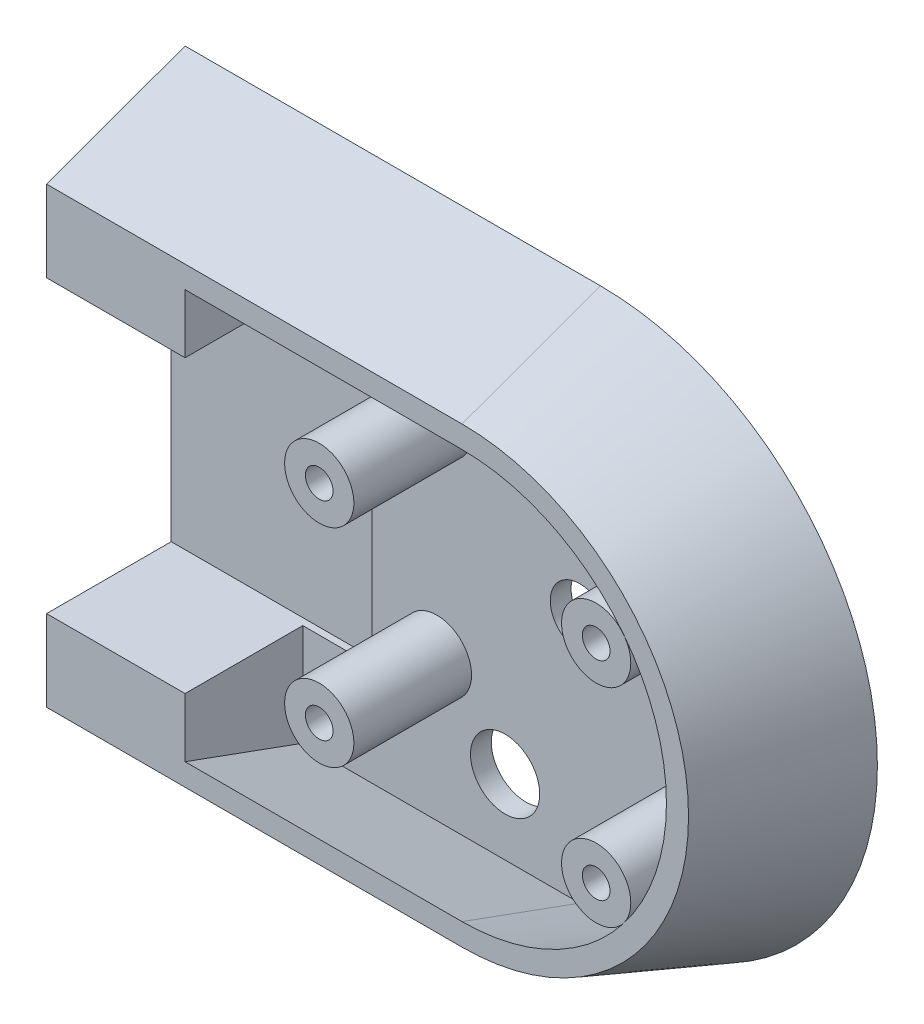
ISO-10303-21;
HEADER;
FILE_DESCRIPTION(('STEP AP214'),'2;1');
FILE_NAME('part.step','',(''),(''),'','','');
FILE_SCHEMA(('AUTOMOTIVE_DESIGN { 1 0 10303 214 1 1 1 1 }'));
ENDSEC;
DATA;
#1=APPLICATION_CONTEXT('core data for automotive mechanical design processes');
#2=APPLICATION_PROTOCOL_DEFINITION('international standard','automotive_design',2000,#1);
#3=PRODUCT_CONTEXT('',#1,'mechanical');
#4=PRODUCT('Part','Part','',(#3));
#5=PRODUCT_RELATED_PRODUCT_CATEGORY('part','',(#4));
#6=PRODUCT_DEFINITION_FORMATION('','',#4);
#7=PRODUCT_DEFINITION_CONTEXT('part definition',#1,'design');
#8=PRODUCT_DEFINITION('design','',#6,#7);
#9=PRODUCT_DEFINITION_SHAPE('','',#8);
#10=(LENGTH_UNIT() NAMED_UNIT(*) SI_UNIT(.MILLI.,.METRE.));
#11=(NAMED_UNIT(*) PLANE_ANGLE_UNIT() SI_UNIT($,.RADIAN.));
#12=(NAMED_UNIT(*) SI_UNIT($,.STERADIAN.) SOLID_ANGLE_UNIT());
#13=UNCERTAINTY_MEASURE_WITH_UNIT(LENGTH_MEASURE(1.E-05),#10,'distance_accuracy_value','');
#14=(GEOMETRIC_REPRESENTATION_CONTEXT(3) GLOBAL_UNCERTAINTY_ASSIGNED_CONTEXT((#13)) GLOBAL_UNIT_ASSIGNED_CONTEXT((#10,
#11,#12)) REPRESENTATION_CONTEXT('',''));
#15=CARTESIAN_POINT('',(0.,0.,0.));
#16=DIRECTION('',(0.,0.,1.));
#17=DIRECTION('',(1.,0.,0.));
#18=AXIS2_PLACEMENT_3D('',#15,#16,#17);
#19=CARTESIAN_POINT('',(-40.,0.,3.));
#20=DIRECTION('',(0.,0.,1.));
#21=DIRECTION('',(1.,0.,0.));
#22=AXIS2_PLACEMENT_3D('',#19,#20,#21);
#23=PLANE('',#22);
#24=CARTESIAN_POINT('',(129.377425117888,-15.,3.));
#25=DIRECTION('',(0.,0.,1.));
#26=DIRECTION('',(1.,0.,0.));
#27=AXIS2_PLACEMENT_3D('',#24,#25,#26);
#28=CIRCLE('',#27,5.00000000000002);
#29=CARTESIAN_POINT('',(134.377425117888,-15.,3.));
#30=VERTEX_POINT('',#29);
#31=EDGE_CURVE('E537',#30,#30,#28,.T.);
#32=ORIENTED_EDGE('',*,*,#31,.F.);
#33=EDGE_LOOP('',(#32));
#34=FACE_BOUND('',#33,.T.);
#35=CARTESIAN_POINT('',(129.377425117888,15.,3.));
#36=DIRECTION('',(0.,0.,1.));
#37=DIRECTION('',(1.,0.,0.));
#38=AXIS2_PLACEMENT_3D('',#35,#36,#37);
#39=CIRCLE('',#38,5.00000000000002);
#40=CARTESIAN_POINT('',(134.377425117888,15.,3.));
#41=VERTEX_POINT('',#40);
#42=EDGE_CURVE('E308',#41,#41,#39,.T.);
#43=ORIENTED_EDGE('',*,*,#42,.F.);
#44=EDGE_LOOP('',(#43));
#45=FACE_BOUND('',#44,.T.);
#46=DIRECTION('',(-1.,0.,0.));
#47=VECTOR('',#46,1.);
#48=CARTESIAN_POINT('',(50.,21.,3.));
#49=LINE('',#48,#47);
#50=CARTESIAN_POINT('',(80.,21.,3.));
#51=VERTEX_POINT('',#50);
#52=CARTESIAN_POINT('',(70.,21.,3.));
#53=VERTEX_POINT('',#52);
#54=EDGE_CURVE('E302',#51,#53,#49,.T.);
#55=ORIENTED_EDGE('',*,*,#54,.F.);
#56=DIRECTION('',(0.,1.,0.));
#57=VECTOR('',#56,1.);
#58=CARTESIAN_POINT('',(80.,21.,3.));
#59=LINE('',#58,#57);
#60=CARTESIAN_POINT('',(80.,-21.,3.));
#61=VERTEX_POINT('',#60);
#62=EDGE_CURVE('E305',#61,#51,#59,.T.);
#63=ORIENTED_EDGE('',*,*,#62,.F.);
#64=DIRECTION('',(1.,0.,0.));
#65=VECTOR('',#64,1.);
#66=CARTESIAN_POINT('',(50.,-21.,3.));
#67=LINE('',#66,#65);
#68=CARTESIAN_POINT('',(70.,-21.,3.));
#69=VERTEX_POINT('',#68);
#70=EDGE_CURVE('E315',#69,#61,#67,.T.);
#71=ORIENTED_EDGE('',*,*,#70,.F.);
#72=DIRECTION('',(0.,1.,0.));
#73=VECTOR('',#72,1.);
#74=CARTESIAN_POINT('',(70.,-35.7155559797737,3.));
#75=LINE('',#74,#73);
#76=CARTESIAN_POINT('',(70.,-35.7155559797737,3.));
#77=VERTEX_POINT('',#76);
#78=EDGE_CURVE('E183',#77,#69,#75,.T.);
#79=ORIENTED_EDGE('',*,*,#78,.F.);
#80=DIRECTION('',(-1.,0.,0.));
#81=VECTOR('',#80,1.);
#82=CARTESIAN_POINT('',(-40.,-35.7155559797737,3.));
#83=LINE('',#82,#81);
#84=CARTESIAN_POINT('',(110.,-35.7155559797737,3.));
#85=VERTEX_POINT('',#84);
#86=EDGE_CURVE('E481',#77,#85,#83,.F.);
#87=ORIENTED_EDGE('',*,*,#86,.T.);
#88=CARTESIAN_POINT('',(110.,0.,3.));
#89=DIRECTION('',(0.,0.,1.));
#90=DIRECTION('',(1.,0.,0.));
#91=AXIS2_PLACEMENT_3D('',#88,#89,#90);
#92=CIRCLE('',#91,35.7155559797737);
#93=CARTESIAN_POINT('',(110.,35.7155559797737,3.));
#94=VERTEX_POINT('',#93);
#95=EDGE_CURVE('E489',#85,#94,#92,.T.);
#96=ORIENTED_EDGE('',*,*,#95,.T.);
#97=DIRECTION('',(1.,0.,0.));
#98=VECTOR('',#97,1.);
#99=CARTESIAN_POINT('',(-40.,35.7155559797737,3.));
#100=LINE('',#99,#98);
#101=CARTESIAN_POINT('',(70.,35.7155559797737,3.));
#102=VERTEX_POINT('',#101);
#103=EDGE_CURVE('E482',#94,#102,#100,.F.);
#104=ORIENTED_EDGE('',*,*,#103,.T.);
#105=DIRECTION('',(0.,1.,0.));
#106=VECTOR('',#105,1.);
#107=CARTESIAN_POINT('',(70.,35.7155559797737,3.));
#108=LINE('',#107,#106);
#109=EDGE_CURVE('E370',#53,#102,#108,.T.);
#110=ORIENTED_EDGE('',*,*,#109,.F.);
#111=EDGE_LOOP('',(#55,#63,#71,#79,#87,#96,#104,#110));
#112=FACE_BOUND('',#111,.T.);
#113=CARTESIAN_POINT('',(110.,0.,3.));
#114=DIRECTION('',(0.,0.,1.));
#115=DIRECTION('',(1.,0.,0.));
#116=AXIS2_PLACEMENT_3D('',#113,#114,#115);
#117=CIRCLE('',#116,4.25000000000001);
#118=CARTESIAN_POINT('',(114.25,0.,3.));
#119=VERTEX_POINT('',#118);
#120=EDGE_CURVE('E405',#119,#119,#117,.T.);
#121=ORIENTED_EDGE('',*,*,#120,.F.);
#122=EDGE_LOOP('',(#121));
#123=FACE_BOUND('',#122,.T.);
#124=CARTESIAN_POINT('',(99.2269745441613,-24.9632167242717,3.));
#125=DIRECTION('',(0.,0.,-1.));
#126=DIRECTION('',(-1.,0.,0.));
#127=AXIS2_PLACEMENT_3D('',#124,#125,#126);
#128=CIRCLE('',#127,5.);
#129=CARTESIAN_POINT('',(94.2269745441613,-24.9632167242717,3.));
#130=VERTEX_POINT('',#129);
#131=EDGE_CURVE('E431',#130,#130,#128,.T.);
#132=ORIENTED_EDGE('',*,*,#131,.T.);
#133=EDGE_LOOP('',(#132));
#134=FACE_BOUND('',#133,.T.);
#135=CARTESIAN_POINT('',(89.3774251178879,-15.,3.));
#136=DIRECTION('',(0.,0.,1.));
#137=DIRECTION('',(1.,0.,0.));
#138=AXIS2_PLACEMENT_3D('',#135,#136,#137);
#139=CIRCLE('',#138,5.);
#140=CARTESIAN_POINT('',(94.3774251178879,-15.,3.));
#141=VERTEX_POINT('',#140);
#142=EDGE_CURVE('E443',#141,#141,#139,.T.);
#143=ORIENTED_EDGE('',*,*,#142,.F.);
#144=EDGE_LOOP('',(#143));
#145=FACE_BOUND('',#144,.T.);
#146=CARTESIAN_POINT('',(89.3774251178879,15.,3.));
#147=DIRECTION('',(0.,0.,1.));
#148=DIRECTION('',(1.,0.,0.));
#149=AXIS2_PLACEMENT_3D('',#146,#147,#148);
#150=CIRCLE('',#149,5.);
#151=CARTESIAN_POINT('',(94.3774251178879,15.,3.));
#152=VERTEX_POINT('',#151);
#153=EDGE_CURVE('E450',#152,#152,#150,.T.);
#154=ORIENTED_EDGE('',*,*,#153,.F.);
#155=EDGE_LOOP('',(#154));
#156=FACE_BOUND('',#155,.T.);
#157=ADVANCED_FACE('F168',(#34,#45,#112,#123,#134,#145,#156),#23,.T.);
#158=CARTESIAN_POINT('',(-40.,-37.1809221376423,-1.02606042997701));
#159=DIRECTION('',(0.,-0.939692620785908,0.342020143325669));
#160=DIRECTION('',(0.,-0.342020143325669,-0.939692620785909));
#161=AXIS2_PLACEMENT_3D('',#158,#159,#160);
#162=PLANE('',#161);
#163=ORIENTED_EDGE('',*,*,#86,.F.);
#164=DIRECTION('',(0.,-0.342020143325669,-0.939692620785909));
#165=VECTOR('',#164,1.);
#166=CARTESIAN_POINT('',(70.,-37.1809221376423,-1.026060429977));
#167=LINE('',#166,#165);
#168=CARTESIAN_POINT('',(70.,-29.5280619972482,20.));
#169=VERTEX_POINT('',#168);
#170=EDGE_CURVE('E190',#77,#169,#167,.F.);
#171=ORIENTED_EDGE('',*,*,#170,.T.);
#172=DIRECTION('',(-1.,0.,0.));
#173=VECTOR('',#172,1.);
#174=CARTESIAN_POINT('',(-40.,-29.5280619972482,20.));
#175=LINE('',#174,#173);
#176=CARTESIAN_POINT('',(110.,-29.5280619972482,20.));
#177=VERTEX_POINT('',#176);
#178=EDGE_CURVE('E454',#169,#177,#175,.F.);
#179=ORIENTED_EDGE('',*,*,#178,.T.);
#180=DIRECTION('',(0.,-0.342020143325669,-0.939692620785908));
#181=VECTOR('',#180,1.);
#182=CARTESIAN_POINT('',(110.,-37.1809221376423,-1.02606042997701));
#183=LINE('',#182,#181);
#184=EDGE_CURVE('E493',#177,#85,#183,.T.);
#185=ORIENTED_EDGE('',*,*,#184,.T.);
#186=EDGE_LOOP('',(#163,#171,#179,#185));
#187=FACE_BOUND('',#186,.T.);
#188=ADVANCED_FACE('F525',(#187),#162,.F.);
#189=CARTESIAN_POINT('',(-40.,-40.,0.));
#190=DIRECTION('',(0.,-0.939692620785908,0.342020143325669));
#191=DIRECTION('',(0.,-0.342020143325669,-0.939692620785909));
#192=AXIS2_PLACEMENT_3D('',#189,#190,#191);
#193=PLANE('',#192);
#194=DIRECTION('',(-1.,0.,0.));
#195=VECTOR('',#194,1.);
#196=CARTESIAN_POINT('',(-40.,-32.7205953146759,20.));
#197=LINE('',#196,#195);
#198=CARTESIAN_POINT('',(50.,-32.720595314676,20.));
#199=VERTEX_POINT('',#198);
#200=CARTESIAN_POINT('',(110.,-32.720595314676,20.));
#201=VERTEX_POINT('',#200);
#202=EDGE_CURVE('E460',#199,#201,#197,.F.);
#203=ORIENTED_EDGE('',*,*,#202,.F.);
#204=DIRECTION('',(0.,-0.342020143325669,-0.939692620785908));
#205=VECTOR('',#204,1.);
#206=CARTESIAN_POINT('',(50.,-40.,0.));
#207=LINE('',#206,#205);
#208=CARTESIAN_POINT('',(50.,-40.,0.));
#209=VERTEX_POINT('',#208);
#210=EDGE_CURVE('E398',#209,#199,#207,.F.);
#211=ORIENTED_EDGE('',*,*,#210,.F.);
#212=DIRECTION('',(1.,0.,0.));
#213=VECTOR('',#212,1.);
#214=CARTESIAN_POINT('',(-40.,-40.,0.));
#215=LINE('',#214,#213);
#216=CARTESIAN_POINT('',(110.,-40.,0.));
#217=VERTEX_POINT('',#216);
#218=EDGE_CURVE('E463',#209,#217,#215,.T.);
#219=ORIENTED_EDGE('',*,*,#218,.T.);
#220=DIRECTION('',(0.,-0.342020143325669,-0.939692620785908));
#221=VECTOR('',#220,1.);
#222=CARTESIAN_POINT('',(110.,-40.,0.));
#223=LINE('',#222,#221);
#224=EDGE_CURVE('E477',#201,#217,#223,.T.);
#225=ORIENTED_EDGE('',*,*,#224,.F.);
#226=EDGE_LOOP('',(#203,#211,#219,#225));
#227=FACE_BOUND('',#226,.T.);
#228=ADVANCED_FACE('F532',(#227),#193,.T.);
#229=CARTESIAN_POINT('',(-40.,37.1809221376423,-1.02606042997701));
#230=DIRECTION('',(0.,0.939692620785908,0.342020143325669));
#231=DIRECTION('',(0.,-0.342020143325669,0.939692620785909));
#232=AXIS2_PLACEMENT_3D('',#229,#230,#231);
#233=PLANE('',#232);
#234=DIRECTION('',(1.,0.,0.));
#235=VECTOR('',#234,1.);
#236=CARTESIAN_POINT('',(-40.,29.5280619972482,20.));
#237=LINE('',#236,#235);
#238=CARTESIAN_POINT('',(110.,29.5280619972482,20.));
#239=VERTEX_POINT('',#238);
#240=CARTESIAN_POINT('',(70.,29.5280619972482,20.));
#241=VERTEX_POINT('',#240);
#242=EDGE_CURVE('E176',#239,#241,#237,.F.);
#243=ORIENTED_EDGE('',*,*,#242,.T.);
#244=DIRECTION('',(0.,-0.342020143325669,0.939692620785909));
#245=VECTOR('',#244,1.);
#246=CARTESIAN_POINT('',(70.,37.1809221376423,-1.02606042997701));
#247=LINE('',#246,#245);
#248=EDGE_CURVE('E388',#241,#102,#247,.F.);
#249=ORIENTED_EDGE('',*,*,#248,.T.);
#250=ORIENTED_EDGE('',*,*,#103,.F.);
#251=DIRECTION('',(0.,-0.342020143325669,0.939692620785909));
#252=VECTOR('',#251,1.);
#253=CARTESIAN_POINT('',(110.,37.1809221376423,-1.02606042997701));
#254=LINE('',#253,#252);
#255=EDGE_CURVE('E486',#239,#94,#254,.F.);
#256=ORIENTED_EDGE('',*,*,#255,.F.);
#257=EDGE_LOOP('',(#243,#249,#250,#256));
#258=FACE_BOUND('',#257,.T.);
#259=ADVANCED_FACE('F580',(#258),#233,.F.);
#260=CARTESIAN_POINT('',(-40.,40.,0.));
#261=DIRECTION('',(0.,0.939692620785908,0.342020143325669));
#262=DIRECTION('',(0.,-0.342020143325669,0.939692620785909));
#263=AXIS2_PLACEMENT_3D('',#260,#261,#262);
#264=PLANE('',#263);
#265=DIRECTION('',(0.,-0.342020143325669,0.939692620785908));
#266=VECTOR('',#265,1.);
#267=CARTESIAN_POINT('',(50.,40.,0.));
#268=LINE('',#267,#266);
#269=CARTESIAN_POINT('',(50.,32.7205953146759,20.));
#270=VERTEX_POINT('',#269);
#271=CARTESIAN_POINT('',(50.,40.,0.));
#272=VERTEX_POINT('',#271);
#273=EDGE_CURVE('E395',#270,#272,#268,.F.);
#274=ORIENTED_EDGE('',*,*,#273,.F.);
#275=DIRECTION('',(1.,0.,0.));
#276=VECTOR('',#275,1.);
#277=CARTESIAN_POINT('',(-40.,32.7205953146759,20.));
#278=LINE('',#277,#276);
#279=CARTESIAN_POINT('',(110.,32.7205953146759,20.));
#280=VERTEX_POINT('',#279);
#281=EDGE_CURVE('E457',#280,#270,#278,.F.);
#282=ORIENTED_EDGE('',*,*,#281,.F.);
#283=DIRECTION('',(0.,0.342020143325669,-0.939692620785908));
#284=VECTOR('',#283,1.);
#285=CARTESIAN_POINT('',(110.,40.,0.));
#286=LINE('',#285,#284);
#287=CARTESIAN_POINT('',(110.,40.,0.));
#288=VERTEX_POINT('',#287);
#289=EDGE_CURVE('E474',#280,#288,#286,.T.);
#290=ORIENTED_EDGE('',*,*,#289,.T.);
#291=DIRECTION('',(-1.,0.,0.));
#292=VECTOR('',#291,1.);
#293=CARTESIAN_POINT('',(-40.,40.,0.));
#294=LINE('',#293,#292);
#295=EDGE_CURVE('E470',#288,#272,#294,.T.);
#296=ORIENTED_EDGE('',*,*,#295,.T.);
#297=EDGE_LOOP('',(#274,#282,#290,#296));
#298=FACE_BOUND('',#297,.T.);
#299=ADVANCED_FACE('F573',(#298),#264,.T.);
#300=CARTESIAN_POINT('',(0.,0.,20.));
#301=DIRECTION('',(0.,0.,1.));
#302=DIRECTION('',(1.,0.,0.));
#303=AXIS2_PLACEMENT_3D('',#300,#301,#302);
#304=PLANE('',#303);
#305=ORIENTED_EDGE('',*,*,#281,.T.);
#306=DIRECTION('',(0.,1.,0.));
#307=VECTOR('',#306,1.);
#308=CARTESIAN_POINT('',(50.,40.,20.));
#309=LINE('',#308,#307);
#310=CARTESIAN_POINT('',(50.,21.,20.));
#311=VERTEX_POINT('',#310);
#312=EDGE_CURVE('E391',#311,#270,#309,.T.);
#313=ORIENTED_EDGE('',*,*,#312,.F.);
#314=DIRECTION('',(1.,0.,0.));
#315=VECTOR('',#314,1.);
#316=CARTESIAN_POINT('',(50.,21.,20.));
#317=LINE('',#316,#315);
#318=CARTESIAN_POINT('',(70.,21.,20.));
#319=VERTEX_POINT('',#318);
#320=EDGE_CURVE('E371',#311,#319,#317,.T.);
#321=ORIENTED_EDGE('',*,*,#320,.T.);
#322=DIRECTION('',(0.,1.,0.));
#323=VECTOR('',#322,1.);
#324=CARTESIAN_POINT('',(70.,35.7155559797737,20.));
#325=LINE('',#324,#323);
#326=EDGE_CURVE('E374',#319,#241,#325,.T.);
#327=ORIENTED_EDGE('',*,*,#326,.T.);
#328=ORIENTED_EDGE('',*,*,#242,.F.);
#329=CARTESIAN_POINT('',(110.,0.,20.));
#330=DIRECTION('',(0.,0.,-1.));
#331=DIRECTION('',(-1.,0.,0.));
#332=AXIS2_PLACEMENT_3D('',#329,#330,#331);
#333=CIRCLE('',#332,29.5280619972482);
#334=EDGE_CURVE('E426',#239,#177,#333,.T.);
#335=ORIENTED_EDGE('',*,*,#334,.T.);
#336=ORIENTED_EDGE('',*,*,#178,.F.);
#337=DIRECTION('',(0.,1.,0.));
#338=VECTOR('',#337,1.);
#339=CARTESIAN_POINT('',(70.,-35.7155559797737,20.));
#340=LINE('',#339,#338);
#341=CARTESIAN_POINT('',(70.,-21.,20.));
#342=VERTEX_POINT('',#341);
#343=EDGE_CURVE('E363',#169,#342,#340,.T.);
#344=ORIENTED_EDGE('',*,*,#343,.T.);
#345=DIRECTION('',(-1.,0.,0.));
#346=VECTOR('',#345,1.);
#347=CARTESIAN_POINT('',(50.,-21.,20.));
#348=LINE('',#347,#346);
#349=CARTESIAN_POINT('',(50.,-21.,20.));
#350=VERTEX_POINT('',#349);
#351=EDGE_CURVE('E282',#342,#350,#348,.T.);
#352=ORIENTED_EDGE('',*,*,#351,.T.);
#353=EDGE_CURVE('E277',#199,#350,#309,.T.);
#354=ORIENTED_EDGE('',*,*,#353,.F.);
#355=ORIENTED_EDGE('',*,*,#202,.T.);
#356=CARTESIAN_POINT('',(110.,0.,20.));
#357=DIRECTION('',(0.,0.,-1.));
#358=DIRECTION('',(-1.,0.,0.));
#359=AXIS2_PLACEMENT_3D('',#356,#357,#358);
#360=CIRCLE('',#359,32.720595314676);
#361=EDGE_CURVE('E422',#280,#201,#360,.T.);
#362=ORIENTED_EDGE('',*,*,#361,.F.);
#363=EDGE_LOOP('',(#305,#313,#321,#327,#328,#335,#336,#344,#352,#354,#355,#362));
#364=FACE_BOUND('',#363,.T.);
#365=ADVANCED_FACE('F569',(#364),#304,.T.);
#366=CARTESIAN_POINT('',(-40.,0.,0.));
#367=DIRECTION('',(0.,0.,1.));
#368=DIRECTION('',(1.,0.,0.));
#369=AXIS2_PLACEMENT_3D('',#366,#367,#368);
#370=PLANE('',#369);
#371=CARTESIAN_POINT('',(99.2269745441613,-24.9632167242717,0.));
#372=DIRECTION('',(0.,0.,-1.));
#373=DIRECTION('',(-1.,0.,0.));
#374=AXIS2_PLACEMENT_3D('',#371,#372,#373);
#375=CIRCLE('',#374,5.);
#376=CARTESIAN_POINT('',(94.2269745441613,-24.9632167242717,0.));
#377=VERTEX_POINT('',#376);
#378=EDGE_CURVE('E430',#377,#377,#375,.T.);
#379=ORIENTED_EDGE('',*,*,#378,.F.);
#380=EDGE_LOOP('',(#379));
#381=FACE_BOUND('',#380,.T.);
#382=CARTESIAN_POINT('',(110.,0.,0.));
#383=DIRECTION('',(0.,0.,-1.));
#384=DIRECTION('',(-1.,0.,0.));
#385=AXIS2_PLACEMENT_3D('',#382,#383,#384);
#386=CIRCLE('',#385,4.25000000000001);
#387=CARTESIAN_POINT('',(105.75,0.,0.));
#388=VERTEX_POINT('',#387);
#389=EDGE_CURVE('E401',#388,#388,#386,.T.);
#390=ORIENTED_EDGE('',*,*,#389,.F.);
#391=EDGE_LOOP('',(#390));
#392=FACE_BOUND('',#391,.T.);
#393=DIRECTION('',(0.,-1.,0.));
#394=VECTOR('',#393,1.);
#395=CARTESIAN_POINT('',(50.,0.,0.));
#396=LINE('',#395,#394);
#397=EDGE_CURVE('E12',#272,#209,#396,.T.);
#398=ORIENTED_EDGE('',*,*,#397,.F.);
#399=ORIENTED_EDGE('',*,*,#295,.F.);
#400=CARTESIAN_POINT('',(110.,0.,0.));
#401=DIRECTION('',(0.,0.,1.));
#402=DIRECTION('',(1.,0.,0.));
#403=AXIS2_PLACEMENT_3D('',#400,#401,#402);
#404=CIRCLE('',#403,40.);
#405=EDGE_CURVE('E466',#217,#288,#404,.T.);
#406=ORIENTED_EDGE('',*,*,#405,.F.);
#407=ORIENTED_EDGE('',*,*,#218,.F.);
#408=EDGE_LOOP('',(#398,#399,#406,#407));
#409=FACE_BOUND('',#408,.T.);
#410=ADVANCED_FACE('F572',(#381,#392,#409),#370,.F.);
#411=CARTESIAN_POINT('',(89.3774251178879,-15.,3.));
#412=DIRECTION('',(0.,0.,1.));
#413=DIRECTION('',(1.,0.,0.));
#414=AXIS2_PLACEMENT_3D('',#411,#412,#413);
#415=PLANE('',#414);
#416=CARTESIAN_POINT('',(89.3774251178879,-15.,3.));
#417=DIRECTION('',(0.,0.,1.));
#418=DIRECTION('',(1.,0.,0.));
#419=AXIS2_PLACEMENT_3D('',#416,#417,#418);
#420=CIRCLE('',#419,2.);
#421=CARTESIAN_POINT('',(91.3774251178879,-15.,3.));
#422=VERTEX_POINT('',#421);
#423=EDGE_CURVE('E435',#422,#422,#420,.T.);
#424=ORIENTED_EDGE('',*,*,#423,.T.);
#425=EDGE_LOOP('',(#424));
#426=FACE_BOUND('',#425,.T.);
#427=ADVANCED_FACE('F577',(#426),#415,.T.);
#428=CARTESIAN_POINT('',(89.3774251178879,-15.,49.8710844112955));
#429=DIRECTION('',(0.,0.,-1.));
#430=DIRECTION('',(-1.,0.,0.));
#431=AXIS2_PLACEMENT_3D('',#428,#429,#430);
#432=CYLINDRICAL_SURFACE('',#431,2.);
#433=CARTESIAN_POINT('',(89.3774251178879,-15.,20.));
#434=DIRECTION('',(0.,0.,-1.));
#435=DIRECTION('',(-1.,0.,0.));
#436=AXIS2_PLACEMENT_3D('',#433,#434,#435);
#437=CIRCLE('',#436,2.);
#438=CARTESIAN_POINT('',(87.3774251178879,-15.,20.));
#439=VERTEX_POINT('',#438);
#440=EDGE_CURVE('E410',#439,#439,#437,.T.);
#441=ORIENTED_EDGE('',*,*,#440,.F.);
#442=EDGE_LOOP('',(#441));
#443=FACE_BOUND('',#442,.T.);
#444=ORIENTED_EDGE('',*,*,#423,.F.);
#445=EDGE_LOOP('',(#444));
#446=FACE_BOUND('',#445,.T.);
#447=ADVANCED_FACE('F1045',(#443,#446),#432,.F.);
#448=CARTESIAN_POINT('',(150.,32.7205953146759,20.));
#449=DIRECTION('',(0.,0.,-1.));
#450=DIRECTION('',(-1.,0.,0.));
#451=AXIS2_PLACEMENT_3D('',#448,#449,#450);
#452=PLANE('',#451);
#453=ORIENTED_EDGE('',*,*,#440,.T.);
#454=EDGE_LOOP('',(#453));
#455=FACE_BOUND('',#454,.T.);
#456=CARTESIAN_POINT('',(89.3774251178879,-15.,20.));
#457=DIRECTION('',(0.,0.,-1.));
#458=DIRECTION('',(-1.,0.,0.));
#459=AXIS2_PLACEMENT_3D('',#456,#457,#458);
#460=CIRCLE('',#459,5.);
#461=CARTESIAN_POINT('',(84.3774251178879,-15.,20.));
#462=VERTEX_POINT('',#461);
#463=EDGE_CURVE('E414',#462,#462,#460,.T.);
#464=ORIENTED_EDGE('',*,*,#463,.F.);
#465=EDGE_LOOP('',(#464));
#466=FACE_BOUND('',#465,.T.);
#467=ADVANCED_FACE('F522',(#455,#466),#452,.F.);
#468=CARTESIAN_POINT('',(110.,0.,-1.02606042997701));
#469=DIRECTION('',(0.,0.,-1.));
#470=DIRECTION('',(1.,0.,0.));
#471=AXIS2_PLACEMENT_3D('',#468,#469,#470);
#472=CONICAL_SURFACE('',#471,37.1809221376423,0.349065850398866);
#473=ORIENTED_EDGE('',*,*,#334,.F.);
#474=ORIENTED_EDGE('',*,*,#255,.T.);
#475=ORIENTED_EDGE('',*,*,#95,.F.);
#476=ORIENTED_EDGE('',*,*,#184,.F.);
#477=EDGE_LOOP('',(#473,#474,#475,#476));
#478=FACE_BOUND('',#477,.T.);
#479=ADVANCED_FACE('F564',(#478),#472,.F.);
#480=CARTESIAN_POINT('',(110.,0.,0.));
#481=DIRECTION('',(0.,0.,-1.));
#482=DIRECTION('',(1.,0.,0.));
#483=AXIS2_PLACEMENT_3D('',#480,#481,#482);
#484=CONICAL_SURFACE('',#483,40.,0.349065850398866);
#485=ORIENTED_EDGE('',*,*,#289,.F.);
#486=ORIENTED_EDGE('',*,*,#361,.T.);
#487=ORIENTED_EDGE('',*,*,#224,.T.);
#488=ORIENTED_EDGE('',*,*,#405,.T.);
#489=EDGE_LOOP('',(#485,#486,#487,#488));
#490=FACE_BOUND('',#489,.T.);
#491=ADVANCED_FACE('F555',(#490),#484,.T.);
#492=CARTESIAN_POINT('',(89.3774251178879,15.,49.8701991516046));
#493=DIRECTION('',(0.,0.,-1.));
#494=DIRECTION('',(-1.,0.,0.));
#495=AXIS2_PLACEMENT_3D('',#492,#493,#494);
#496=CYLINDRICAL_SURFACE('',#495,5.);
#497=CARTESIAN_POINT('',(89.3774251178879,15.,20.));
#498=DIRECTION('',(0.,0.,-1.));
#499=DIRECTION('',(-1.,0.,0.));
#500=AXIS2_PLACEMENT_3D('',#497,#498,#499);
#501=CIRCLE('',#500,5.);
#502=CARTESIAN_POINT('',(84.3774251178879,15.,20.));
#503=VERTEX_POINT('',#502);
#504=EDGE_CURVE('E418',#503,#503,#501,.T.);
#505=ORIENTED_EDGE('',*,*,#504,.T.);
#506=EDGE_LOOP('',(#505));
#507=FACE_BOUND('',#506,.T.);
#508=ORIENTED_EDGE('',*,*,#153,.T.);
#509=EDGE_LOOP('',(#508));
#510=FACE_BOUND('',#509,.T.);
#511=ADVANCED_FACE('F552',(#507,#510),#496,.T.);
#512=CARTESIAN_POINT('',(89.3774251178879,-15.,49.8701991516046));
#513=DIRECTION('',(0.,0.,-1.));
#514=DIRECTION('',(-1.,0.,0.));
#515=AXIS2_PLACEMENT_3D('',#512,#513,#514);
#516=CYLINDRICAL_SURFACE('',#515,5.);
#517=ORIENTED_EDGE('',*,*,#463,.T.);
#518=EDGE_LOOP('',(#517));
#519=FACE_BOUND('',#518,.T.);
#520=ORIENTED_EDGE('',*,*,#142,.T.);
#521=EDGE_LOOP('',(#520));
#522=FACE_BOUND('',#521,.T.);
#523=ADVANCED_FACE('F554',(#519,#522),#516,.T.);
#524=CARTESIAN_POINT('',(99.2269745441613,-24.9632167242717,3.));
#525=DIRECTION('',(0.,0.,-1.));
#526=DIRECTION('',(-1.,0.,0.));
#527=AXIS2_PLACEMENT_3D('',#524,#525,#526);
#528=CYLINDRICAL_SURFACE('',#527,5.);
#529=ORIENTED_EDGE('',*,*,#131,.F.);
#530=EDGE_LOOP('',(#529));
#531=FACE_BOUND('',#530,.T.);
#532=ORIENTED_EDGE('',*,*,#378,.T.);
#533=EDGE_LOOP('',(#532));
#534=FACE_BOUND('',#533,.T.);
#535=ADVANCED_FACE('F520',(#531,#534),#528,.F.);
#536=CARTESIAN_POINT('',(89.3774251178879,15.,20.));
#537=DIRECTION('',(0.,0.,-1.));
#538=DIRECTION('',(-1.,0.,0.));
#539=AXIS2_PLACEMENT_3D('',#536,#537,#538);
#540=CIRCLE('',#539,2.);
#541=CARTESIAN_POINT('',(87.3774251178879,15.,20.));
#542=VERTEX_POINT('',#541);
#543=EDGE_CURVE('E409',#542,#542,#540,.T.);
#544=ORIENTED_EDGE('',*,*,#543,.T.);
#545=EDGE_LOOP('',(#544));
#546=FACE_BOUND('',#545,.T.);
#547=ORIENTED_EDGE('',*,*,#504,.F.);
#548=EDGE_LOOP('',(#547));
#549=FACE_BOUND('',#548,.T.);
#550=ADVANCED_FACE('F504',(#546,#549),#452,.F.);
#551=CARTESIAN_POINT('',(89.3774251178879,15.,3.));
#552=DIRECTION('',(0.,0.,1.));
#553=DIRECTION('',(1.,0.,0.));
#554=AXIS2_PLACEMENT_3D('',#551,#552,#553);
#555=PLANE('',#554);
#556=CARTESIAN_POINT('',(89.3774251178879,15.,3.));
#557=DIRECTION('',(0.,0.,1.));
#558=DIRECTION('',(1.,0.,0.));
#559=AXIS2_PLACEMENT_3D('',#556,#557,#558);
#560=CIRCLE('',#559,2.);
#561=CARTESIAN_POINT('',(91.3774251178879,15.,3.));
#562=VERTEX_POINT('',#561);
#563=EDGE_CURVE('E439',#562,#562,#560,.T.);
#564=ORIENTED_EDGE('',*,*,#563,.T.);
#565=EDGE_LOOP('',(#564));
#566=FACE_BOUND('',#565,.T.);
#567=ADVANCED_FACE('F511',(#566),#555,.T.);
#568=CARTESIAN_POINT('',(89.3774251178879,15.,49.8710844112955));
#569=DIRECTION('',(0.,0.,-1.));
#570=DIRECTION('',(-1.,0.,0.));
#571=AXIS2_PLACEMENT_3D('',#568,#569,#570);
#572=CYLINDRICAL_SURFACE('',#571,2.);
#573=ORIENTED_EDGE('',*,*,#543,.F.);
#574=EDGE_LOOP('',(#573));
#575=FACE_BOUND('',#574,.T.);
#576=ORIENTED_EDGE('',*,*,#563,.F.);
#577=EDGE_LOOP('',(#576));
#578=FACE_BOUND('',#577,.T.);
#579=ADVANCED_FACE('F507',(#575,#578),#572,.F.);
#580=CARTESIAN_POINT('',(110.,0.,15.));
#581=DIRECTION('',(0.,0.,-1.));
#582=DIRECTION('',(-1.,0.,0.));
#583=AXIS2_PLACEMENT_3D('',#580,#581,#582);
#584=CYLINDRICAL_SURFACE('',#583,4.25000000000001);
#585=ORIENTED_EDGE('',*,*,#120,.T.);
#586=EDGE_LOOP('',(#585));
#587=FACE_BOUND('',#586,.T.);
#588=ORIENTED_EDGE('',*,*,#389,.T.);
#589=EDGE_LOOP('',(#588));
#590=FACE_BOUND('',#589,.T.);
#591=ADVANCED_FACE('F510',(#587,#590),#584,.F.);
#592=CARTESIAN_POINT('',(50.,40.,20.));
#593=DIRECTION('',(-1.,0.,0.));
#594=DIRECTION('',(0.,-1.,0.));
#595=AXIS2_PLACEMENT_3D('',#592,#593,#594);
#596=PLANE('',#595);
#597=DIRECTION('',(0.,-1.,0.));
#598=VECTOR('',#597,1.);
#599=CARTESIAN_POINT('',(50.,21.,2.));
#600=LINE('',#599,#598);
#601=CARTESIAN_POINT('',(50.,21.,2.));
#602=VERTEX_POINT('',#601);
#603=CARTESIAN_POINT('',(50.,-21.,2.));
#604=VERTEX_POINT('',#603);
#605=EDGE_CURVE('E274',#602,#604,#600,.T.);
#606=ORIENTED_EDGE('',*,*,#605,.F.);
#607=DIRECTION('',(0.,0.,-1.));
#608=VECTOR('',#607,1.);
#609=CARTESIAN_POINT('',(50.,21.,20.));
#610=LINE('',#609,#608);
#611=EDGE_CURVE('E385',#311,#602,#610,.T.);
#612=ORIENTED_EDGE('',*,*,#611,.F.);
#613=ORIENTED_EDGE('',*,*,#312,.T.);
#614=ORIENTED_EDGE('',*,*,#273,.T.);
#615=ORIENTED_EDGE('',*,*,#397,.T.);
#616=ORIENTED_EDGE('',*,*,#210,.T.);
#617=ORIENTED_EDGE('',*,*,#353,.T.);
#618=DIRECTION('',(0.,0.,-1.));
#619=VECTOR('',#618,1.);
#620=CARTESIAN_POINT('',(50.,-21.,20.));
#621=LINE('',#620,#619);
#622=EDGE_CURVE('E268',#350,#604,#621,.T.);
#623=ORIENTED_EDGE('',*,*,#622,.T.);
#624=EDGE_LOOP('',(#606,#612,#613,#614,#615,#616,#617,#623));
#625=FACE_BOUND('',#624,.T.);
#626=CARTESIAN_POINT('',(50.,24.,17.));
#627=DIRECTION('',(-1.,0.,0.));
#628=DIRECTION('',(0.,-1.,0.));
#629=AXIS2_PLACEMENT_3D('',#626,#627,#628);
#630=CIRCLE('',#629,2.00000000000001);
#631=CARTESIAN_POINT('',(50.,22.,17.));
#632=VERTEX_POINT('',#631);
#633=EDGE_CURVE('E345',#632,#632,#630,.T.);
#634=ORIENTED_EDGE('',*,*,#633,.F.);
#635=EDGE_LOOP('',(#634));
#636=FACE_BOUND('',#635,.T.);
#637=CARTESIAN_POINT('',(50.,-24.,17.));
#638=DIRECTION('',(-1.,0.,0.));
#639=DIRECTION('',(0.,-1.,0.));
#640=AXIS2_PLACEMENT_3D('',#637,#638,#639);
#641=CIRCLE('',#640,2.00000000000001);
#642=CARTESIAN_POINT('',(50.,-26.,17.));
#643=VERTEX_POINT('',#642);
#644=EDGE_CURVE('E337',#643,#643,#641,.T.);
#645=ORIENTED_EDGE('',*,*,#644,.F.);
#646=EDGE_LOOP('',(#645));
#647=FACE_BOUND('',#646,.T.);
#648=CARTESIAN_POINT('',(50.,-24.,7.));
#649=DIRECTION('',(-1.,0.,0.));
#650=DIRECTION('',(0.,-1.,0.));
#651=AXIS2_PLACEMENT_3D('',#648,#649,#650);
#652=CIRCLE('',#651,2.);
#653=CARTESIAN_POINT('',(50.,-26.,7.));
#654=VERTEX_POINT('',#653);
#655=EDGE_CURVE('E328',#654,#654,#652,.T.);
#656=ORIENTED_EDGE('',*,*,#655,.F.);
#657=EDGE_LOOP('',(#656));
#658=FACE_BOUND('',#657,.T.);
#659=CARTESIAN_POINT('',(50.,24.,7.));
#660=DIRECTION('',(-1.,0.,0.));
#661=DIRECTION('',(0.,-1.,0.));
#662=AXIS2_PLACEMENT_3D('',#659,#660,#661);
#663=CIRCLE('',#662,2.);
#664=CARTESIAN_POINT('',(50.,22.,7.));
#665=VERTEX_POINT('',#664);
#666=EDGE_CURVE('E332',#665,#665,#663,.T.);
#667=ORIENTED_EDGE('',*,*,#666,.F.);
#668=EDGE_LOOP('',(#667));
#669=FACE_BOUND('',#668,.T.);
#670=ADVANCED_FACE('F270',(#625,#636,#647,#658,#669),#596,.T.);
#671=CARTESIAN_POINT('',(70.,35.7155559797737,20.));
#672=DIRECTION('',(-1.,0.,0.));
#673=DIRECTION('',(0.,0.,1.));
#674=AXIS2_PLACEMENT_3D('',#671,#672,#673);
#675=PLANE('',#674);
#676=ORIENTED_EDGE('',*,*,#248,.F.);
#677=ORIENTED_EDGE('',*,*,#326,.F.);
#678=DIRECTION('',(0.,0.,-1.));
#679=VECTOR('',#678,1.);
#680=CARTESIAN_POINT('',(70.,21.,20.));
#681=LINE('',#680,#679);
#682=EDGE_CURVE('E378',#319,#53,#681,.T.);
#683=ORIENTED_EDGE('',*,*,#682,.T.);
#684=ORIENTED_EDGE('',*,*,#109,.T.);
#685=EDGE_LOOP('',(#676,#677,#683,#684));
#686=FACE_BOUND('',#685,.T.);
#687=ADVANCED_FACE('F599',(#686),#675,.F.);
#688=CARTESIAN_POINT('',(50.,21.,20.));
#689=DIRECTION('',(0.,1.,0.));
#690=DIRECTION('',(-1.,0.,0.));
#691=AXIS2_PLACEMENT_3D('',#688,#689,#690);
#692=PLANE('',#691);
#693=ORIENTED_EDGE('',*,*,#611,.T.);
#694=DIRECTION('',(-1.,0.,0.));
#695=VECTOR('',#694,1.);
#696=CARTESIAN_POINT('',(50.,21.,2.));
#697=LINE('',#696,#695);
#698=CARTESIAN_POINT('',(80.,21.,2.));
#699=VERTEX_POINT('',#698);
#700=EDGE_CURVE('E300',#699,#602,#697,.T.);
#701=ORIENTED_EDGE('',*,*,#700,.F.);
#702=DIRECTION('',(0.,0.,1.));
#703=VECTOR('',#702,1.);
#704=CARTESIAN_POINT('',(80.,21.,2.));
#705=LINE('',#704,#703);
#706=EDGE_CURVE('E322',#699,#51,#705,.T.);
#707=ORIENTED_EDGE('',*,*,#706,.T.);
#708=ORIENTED_EDGE('',*,*,#54,.T.);
#709=ORIENTED_EDGE('',*,*,#682,.F.);
#710=ORIENTED_EDGE('',*,*,#320,.F.);
#711=EDGE_LOOP('',(#693,#701,#707,#708,#709,#710));
#712=FACE_BOUND('',#711,.T.);
#713=ADVANCED_FACE('F603',(#712),#692,.F.);
#714=CARTESIAN_POINT('',(50.,-21.,20.));
#715=DIRECTION('',(0.,-1.,0.));
#716=DIRECTION('',(1.,0.,0.));
#717=AXIS2_PLACEMENT_3D('',#714,#715,#716);
#718=PLANE('',#717);
#719=DIRECTION('',(0.,0.,-1.));
#720=VECTOR('',#719,1.);
#721=CARTESIAN_POINT('',(70.,-21.,20.));
#722=LINE('',#721,#720);
#723=EDGE_CURVE('E283',#342,#69,#722,.T.);
#724=ORIENTED_EDGE('',*,*,#723,.T.);
#725=ORIENTED_EDGE('',*,*,#70,.T.);
#726=DIRECTION('',(0.,0.,1.));
#727=VECTOR('',#726,1.);
#728=CARTESIAN_POINT('',(80.,-21.,2.));
#729=LINE('',#728,#727);
#730=CARTESIAN_POINT('',(80.,-21.,2.));
#731=VERTEX_POINT('',#730);
#732=EDGE_CURVE('E290',#731,#61,#729,.T.);
#733=ORIENTED_EDGE('',*,*,#732,.F.);
#734=DIRECTION('',(1.,0.,0.));
#735=VECTOR('',#734,1.);
#736=CARTESIAN_POINT('',(50.,-21.,2.));
#737=LINE('',#736,#735);
#738=EDGE_CURVE('E286',#604,#731,#737,.T.);
#739=ORIENTED_EDGE('',*,*,#738,.F.);
#740=ORIENTED_EDGE('',*,*,#622,.F.);
#741=ORIENTED_EDGE('',*,*,#351,.F.);
#742=EDGE_LOOP('',(#724,#725,#733,#739,#740,#741));
#743=FACE_BOUND('',#742,.T.);
#744=ADVANCED_FACE('F288',(#743),#718,.F.);
#745=CARTESIAN_POINT('',(70.,-35.7155559797737,20.));
#746=DIRECTION('',(-1.,0.,0.));
#747=DIRECTION('',(0.,0.,1.));
#748=AXIS2_PLACEMENT_3D('',#745,#746,#747);
#749=PLANE('',#748);
#750=ORIENTED_EDGE('',*,*,#170,.F.);
#751=ORIENTED_EDGE('',*,*,#78,.T.);
#752=ORIENTED_EDGE('',*,*,#723,.F.);
#753=ORIENTED_EDGE('',*,*,#343,.F.);
#754=EDGE_LOOP('',(#750,#751,#752,#753));
#755=FACE_BOUND('',#754,.T.);
#756=ADVANCED_FACE('F609',(#755),#749,.F.);
#757=CARTESIAN_POINT('',(60.,24.,7.));
#758=DIRECTION('',(-1.,0.,0.));
#759=DIRECTION('',(0.,-1.,0.));
#760=AXIS2_PLACEMENT_3D('',#757,#758,#759);
#761=CYLINDRICAL_SURFACE('',#760,2.);
#762=CARTESIAN_POINT('',(60.,24.,7.));
#763=DIRECTION('',(-1.,0.,0.));
#764=DIRECTION('',(0.,-1.,0.));
#765=AXIS2_PLACEMENT_3D('',#762,#763,#764);
#766=CIRCLE('',#765,2.);
#767=CARTESIAN_POINT('',(60.,22.,7.));
#768=VERTEX_POINT('',#767);
#769=EDGE_CURVE('E352',#768,#768,#766,.T.);
#770=ORIENTED_EDGE('',*,*,#769,.F.);
#771=EDGE_LOOP('',(#770));
#772=FACE_BOUND('',#771,.T.);
#773=ORIENTED_EDGE('',*,*,#666,.T.);
#774=EDGE_LOOP('',(#773));
#775=FACE_BOUND('',#774,.T.);
#776=ADVANCED_FACE('F659',(#772,#775),#761,.F.);
#777=CARTESIAN_POINT('',(60.,24.,7.));
#778=DIRECTION('',(-1.,0.,0.));
#779=DIRECTION('',(0.,-1.,0.));
#780=AXIS2_PLACEMENT_3D('',#777,#778,#779);
#781=PLANE('',#780);
#782=ORIENTED_EDGE('',*,*,#769,.T.);
#783=EDGE_LOOP('',(#782));
#784=FACE_BOUND('',#783,.T.);
#785=ADVANCED_FACE('F641',(#784),#781,.T.);
#786=CARTESIAN_POINT('',(60.,-24.,7.));
#787=DIRECTION('',(-1.,0.,0.));
#788=DIRECTION('',(0.,-1.,0.));
#789=AXIS2_PLACEMENT_3D('',#786,#787,#788);
#790=CYLINDRICAL_SURFACE('',#789,2.);
#791=CARTESIAN_POINT('',(60.,-24.,7.));
#792=DIRECTION('',(-1.,0.,0.));
#793=DIRECTION('',(0.,-1.,0.));
#794=AXIS2_PLACEMENT_3D('',#791,#792,#793);
#795=CIRCLE('',#794,2.);
#796=CARTESIAN_POINT('',(60.,-26.,7.));
#797=VERTEX_POINT('',#796);
#798=EDGE_CURVE('E333',#797,#797,#795,.T.);
#799=ORIENTED_EDGE('',*,*,#798,.F.);
#800=EDGE_LOOP('',(#799));
#801=FACE_BOUND('',#800,.T.);
#802=ORIENTED_EDGE('',*,*,#655,.T.);
#803=EDGE_LOOP('',(#802));
#804=FACE_BOUND('',#803,.T.);
#805=ADVANCED_FACE('F637',(#801,#804),#790,.F.);
#806=CARTESIAN_POINT('',(60.,-24.,7.));
#807=DIRECTION('',(-1.,0.,0.));
#808=DIRECTION('',(0.,-1.,0.));
#809=AXIS2_PLACEMENT_3D('',#806,#807,#808);
#810=PLANE('',#809);
#811=ORIENTED_EDGE('',*,*,#798,.T.);
#812=EDGE_LOOP('',(#811));
#813=FACE_BOUND('',#812,.T.);
#814=ADVANCED_FACE('F640',(#813),#810,.T.);
#815=CARTESIAN_POINT('',(60.,-24.,17.));
#816=DIRECTION('',(-1.,0.,0.));
#817=DIRECTION('',(0.,-1.,0.));
#818=AXIS2_PLACEMENT_3D('',#815,#816,#817);
#819=CYLINDRICAL_SURFACE('',#818,2.00000000000001);
#820=CARTESIAN_POINT('',(60.,-24.,17.));
#821=DIRECTION('',(-1.,0.,0.));
#822=DIRECTION('',(0.,-1.,0.));
#823=AXIS2_PLACEMENT_3D('',#820,#821,#822);
#824=CIRCLE('',#823,2.00000000000001);
#825=CARTESIAN_POINT('',(60.,-26.,17.));
#826=VERTEX_POINT('',#825);
#827=EDGE_CURVE('E341',#826,#826,#824,.T.);
#828=ORIENTED_EDGE('',*,*,#827,.F.);
#829=EDGE_LOOP('',(#828));
#830=FACE_BOUND('',#829,.T.);
#831=ORIENTED_EDGE('',*,*,#644,.T.);
#832=EDGE_LOOP('',(#831));
#833=FACE_BOUND('',#832,.T.);
#834=ADVANCED_FACE('F645',(#830,#833),#819,.F.);
#835=CARTESIAN_POINT('',(60.,-24.,17.));
#836=DIRECTION('',(-1.,0.,0.));
#837=DIRECTION('',(0.,-1.,0.));
#838=AXIS2_PLACEMENT_3D('',#835,#836,#837);
#839=PLANE('',#838);
#840=ORIENTED_EDGE('',*,*,#827,.T.);
#841=EDGE_LOOP('',(#840));
#842=FACE_BOUND('',#841,.T.);
#843=ADVANCED_FACE('F649',(#842),#839,.T.);
#844=CARTESIAN_POINT('',(60.,24.,17.));
#845=DIRECTION('',(-1.,0.,0.));
#846=DIRECTION('',(0.,-1.,0.));
#847=AXIS2_PLACEMENT_3D('',#844,#845,#846);
#848=CYLINDRICAL_SURFACE('',#847,2.00000000000001);
#849=CARTESIAN_POINT('',(60.,24.,17.));
#850=DIRECTION('',(-1.,0.,0.));
#851=DIRECTION('',(0.,-1.,0.));
#852=AXIS2_PLACEMENT_3D('',#849,#850,#851);
#853=CIRCLE('',#852,2.00000000000001);
#854=CARTESIAN_POINT('',(60.,22.,17.));
#855=VERTEX_POINT('',#854);
#856=EDGE_CURVE('E325',#855,#855,#853,.T.);
#857=ORIENTED_EDGE('',*,*,#856,.F.);
#858=EDGE_LOOP('',(#857));
#859=FACE_BOUND('',#858,.T.);
#860=ORIENTED_EDGE('',*,*,#633,.T.);
#861=EDGE_LOOP('',(#860));
#862=FACE_BOUND('',#861,.T.);
#863=ADVANCED_FACE('F632',(#859,#862),#848,.F.);
#864=CARTESIAN_POINT('',(60.,24.,17.));
#865=DIRECTION('',(-1.,0.,0.));
#866=DIRECTION('',(0.,-1.,0.));
#867=AXIS2_PLACEMENT_3D('',#864,#865,#866);
#868=PLANE('',#867);
#869=ORIENTED_EDGE('',*,*,#856,.T.);
#870=EDGE_LOOP('',(#869));
#871=FACE_BOUND('',#870,.T.);
#872=ADVANCED_FACE('F624',(#871),#868,.T.);
#873=CARTESIAN_POINT('',(80.,21.,2.));
#874=DIRECTION('',(1.,0.,0.));
#875=DIRECTION('',(0.,0.,-1.));
#876=AXIS2_PLACEMENT_3D('',#873,#874,#875);
#877=PLANE('',#876);
#878=ORIENTED_EDGE('',*,*,#62,.T.);
#879=ORIENTED_EDGE('',*,*,#706,.F.);
#880=DIRECTION('',(0.,1.,0.));
#881=VECTOR('',#880,1.);
#882=CARTESIAN_POINT('',(80.,21.,2.));
#883=LINE('',#882,#881);
#884=EDGE_CURVE('E295',#731,#699,#883,.T.);
#885=ORIENTED_EDGE('',*,*,#884,.F.);
#886=ORIENTED_EDGE('',*,*,#732,.T.);
#887=EDGE_LOOP('',(#878,#879,#885,#886));
#888=FACE_BOUND('',#887,.T.);
#889=ADVANCED_FACE('F622',(#888),#877,.F.);
#890=CARTESIAN_POINT('',(0.,0.,2.));
#891=DIRECTION('',(0.,0.,1.));
#892=DIRECTION('',(1.,0.,0.));
#893=AXIS2_PLACEMENT_3D('',#890,#891,#892);
#894=PLANE('',#893);
#895=ORIENTED_EDGE('',*,*,#605,.T.);
#896=ORIENTED_EDGE('',*,*,#738,.T.);
#897=ORIENTED_EDGE('',*,*,#884,.T.);
#898=ORIENTED_EDGE('',*,*,#700,.T.);
#899=EDGE_LOOP('',(#895,#896,#897,#898));
#900=FACE_BOUND('',#899,.T.);
#901=ADVANCED_FACE('F298',(#900),#894,.T.);
#902=CARTESIAN_POINT('',(129.377425117888,15.,20.));
#903=DIRECTION('',(0.,0.,-1.));
#904=DIRECTION('',(-1.,0.,0.));
#905=AXIS2_PLACEMENT_3D('',#902,#903,#904);
#906=CYLINDRICAL_SURFACE('',#905,5.00000000000002);
#907=CARTESIAN_POINT('',(129.377425117888,15.,20.));
#908=DIRECTION('',(0.,0.,1.));
#909=DIRECTION('',(1.,0.,0.));
#910=AXIS2_PLACEMENT_3D('',#907,#908,#909);
#911=CIRCLE('',#910,5.00000000000002);
#912=CARTESIAN_POINT('',(134.377425117888,15.,20.));
#913=VERTEX_POINT('',#912);
#914=EDGE_CURVE('E318',#913,#913,#911,.T.);
#915=ORIENTED_EDGE('',*,*,#914,.F.);
#916=EDGE_LOOP('',(#915));
#917=FACE_BOUND('',#916,.T.);
#918=ORIENTED_EDGE('',*,*,#42,.T.);
#919=EDGE_LOOP('',(#918));
#920=FACE_BOUND('',#919,.T.);
#921=ADVANCED_FACE('F630',(#917,#920),#906,.T.);
#922=CARTESIAN_POINT('',(129.377425117888,15.,20.));
#923=DIRECTION('',(0.,0.,1.));
#924=DIRECTION('',(1.,0.,0.));
#925=AXIS2_PLACEMENT_3D('',#922,#923,#924);
#926=PLANE('',#925);
#927=CARTESIAN_POINT('',(129.377425117888,15.,20.));
#928=DIRECTION('',(0.,0.,1.));
#929=DIRECTION('',(1.,0.,0.));
#930=AXIS2_PLACEMENT_3D('',#927,#928,#929);
#931=CIRCLE('',#930,2.);
#932=CARTESIAN_POINT('',(131.377425117888,15.,20.));
#933=VERTEX_POINT('',#932);
#934=EDGE_CURVE('E1003',#933,#933,#931,.T.);
#935=ORIENTED_EDGE('',*,*,#934,.F.);
#936=EDGE_LOOP('',(#935));
#937=FACE_BOUND('',#936,.T.);
#938=ORIENTED_EDGE('',*,*,#914,.T.);
#939=EDGE_LOOP('',(#938));
#940=FACE_BOUND('',#939,.T.);
#941=ADVANCED_FACE('F907',(#937,#940),#926,.T.);
#942=CARTESIAN_POINT('',(129.377425117888,-15.,20.));
#943=DIRECTION('',(0.,0.,-1.));
#944=DIRECTION('',(-1.,0.,0.));
#945=AXIS2_PLACEMENT_3D('',#942,#943,#944);
#946=CYLINDRICAL_SURFACE('',#945,5.00000000000002);
#947=CARTESIAN_POINT('',(129.377425117888,-15.,20.));
#948=DIRECTION('',(0.,0.,1.));
#949=DIRECTION('',(1.,0.,0.));
#950=AXIS2_PLACEMENT_3D('',#947,#948,#949);
#951=CIRCLE('',#950,5.00000000000002);
#952=CARTESIAN_POINT('',(134.377425117888,-15.,20.));
#953=VERTEX_POINT('',#952);
#954=EDGE_CURVE('E1002',#953,#953,#951,.T.);
#955=ORIENTED_EDGE('',*,*,#954,.F.);
#956=EDGE_LOOP('',(#955));
#957=FACE_BOUND('',#956,.T.);
#958=ORIENTED_EDGE('',*,*,#31,.T.);
#959=EDGE_LOOP('',(#958));
#960=FACE_BOUND('',#959,.T.);
#961=ADVANCED_FACE('F915',(#957,#960),#946,.T.);
#962=CARTESIAN_POINT('',(129.377425117888,-15.,20.));
#963=DIRECTION('',(0.,0.,1.));
#964=DIRECTION('',(1.,0.,0.));
#965=AXIS2_PLACEMENT_3D('',#962,#963,#964);
#966=PLANE('',#965);
#967=CARTESIAN_POINT('',(129.377425117888,-15.,20.));
#968=DIRECTION('',(0.,0.,1.));
#969=DIRECTION('',(1.,0.,0.));
#970=AXIS2_PLACEMENT_3D('',#967,#968,#969);
#971=CIRCLE('',#970,2.);
#972=CARTESIAN_POINT('',(131.377425117888,-15.,20.));
#973=VERTEX_POINT('',#972);
#974=EDGE_CURVE('E1010',#973,#973,#971,.T.);
#975=ORIENTED_EDGE('',*,*,#974,.F.);
#976=EDGE_LOOP('',(#975));
#977=FACE_BOUND('',#976,.T.);
#978=ORIENTED_EDGE('',*,*,#954,.T.);
#979=EDGE_LOOP('',(#978));
#980=FACE_BOUND('',#979,.T.);
#981=ADVANCED_FACE('F925',(#977,#980),#966,.T.);
#982=CARTESIAN_POINT('',(129.377425117888,-15.,10.));
#983=DIRECTION('',(0.,0.,1.));
#984=DIRECTION('',(1.,0.,0.));
#985=AXIS2_PLACEMENT_3D('',#982,#983,#984);
#986=CYLINDRICAL_SURFACE('',#985,2.);
#987=CARTESIAN_POINT('',(129.377425117888,-15.,10.));
#988=DIRECTION('',(0.,0.,1.));
#989=DIRECTION('',(1.,0.,0.));
#990=AXIS2_PLACEMENT_3D('',#987,#988,#989);
#991=CIRCLE('',#990,2.);
#992=CARTESIAN_POINT('',(131.377425117888,-15.,10.));
#993=VERTEX_POINT('',#992);
#994=EDGE_CURVE('E1016',#993,#993,#991,.T.);
#995=ORIENTED_EDGE('',*,*,#994,.F.);
#996=EDGE_LOOP('',(#995));
#997=FACE_BOUND('',#996,.T.);
#998=ORIENTED_EDGE('',*,*,#974,.T.);
#999=EDGE_LOOP('',(#998));
#1000=FACE_BOUND('',#999,.T.);
#1001=ADVANCED_FACE('F935',(#997,#1000),#986,.F.);
#1002=CARTESIAN_POINT('',(129.377425117888,-15.,10.));
#1003=DIRECTION('',(0.,0.,1.));
#1004=DIRECTION('',(1.,0.,0.));
#1005=AXIS2_PLACEMENT_3D('',#1002,#1003,#1004);
#1006=PLANE('',#1005);
#1007=ORIENTED_EDGE('',*,*,#994,.T.);
#1008=EDGE_LOOP('',(#1007));
#1009=FACE_BOUND('',#1008,.T.);
#1010=ADVANCED_FACE('F945',(#1009),#1006,.T.);
#1011=CARTESIAN_POINT('',(129.377425117888,15.,10.));
#1012=DIRECTION('',(0.,0.,1.));
#1013=DIRECTION('',(1.,0.,0.));
#1014=AXIS2_PLACEMENT_3D('',#1011,#1012,#1013);
#1015=CYLINDRICAL_SURFACE('',#1014,2.);
#1016=CARTESIAN_POINT('',(129.377425117888,15.,10.));
#1017=DIRECTION('',(0.,0.,1.));
#1018=DIRECTION('',(1.,0.,0.));
#1019=AXIS2_PLACEMENT_3D('',#1016,#1017,#1018);
#1020=CIRCLE('',#1019,2.);
#1021=CARTESIAN_POINT('',(131.377425117888,15.,10.));
#1022=VERTEX_POINT('',#1021);
#1023=EDGE_CURVE('E1000',#1022,#1022,#1020,.T.);
#1024=ORIENTED_EDGE('',*,*,#1023,.F.);
#1025=EDGE_LOOP('',(#1024));
#1026=FACE_BOUND('',#1025,.T.);
#1027=ORIENTED_EDGE('',*,*,#934,.T.);
#1028=EDGE_LOOP('',(#1027));
#1029=FACE_BOUND('',#1028,.T.);
#1030=ADVANCED_FACE('F955',(#1026,#1029),#1015,.F.);
#1031=CARTESIAN_POINT('',(129.377425117888,15.,10.));
#1032=DIRECTION('',(0.,0.,1.));
#1033=DIRECTION('',(1.,0.,0.));
#1034=AXIS2_PLACEMENT_3D('',#1031,#1032,#1033);
#1035=PLANE('',#1034);
#1036=ORIENTED_EDGE('',*,*,#1023,.T.);
#1037=EDGE_LOOP('',(#1036));
#1038=FACE_BOUND('',#1037,.T.);
#1039=ADVANCED_FACE('F965',(#1038),#1035,.T.);
#1040=CLOSED_SHELL('',(#157,#188,#228,#259,#299,#365,#410,#427,#447,#467,#479,#491,#511,#523,
#535,#550,#567,#579,#591,#670,#687,#713,#744,#756,#776,#785,#805,#814,#834,#843,#863,#872,#889,
#901,#921,#941,#961,#981,#1001,#1010,#1030,#1039));
#1041=MANIFOLD_SOLID_BREP('B2',#1040);
#1042=ADVANCED_BREP_SHAPE_REPRESENTATION('',(#18,#1041),#14);
#1043=SHAPE_DEFINITION_REPRESENTATION(#9,#1042);
ENDSEC;
END-ISO-10303-21;
